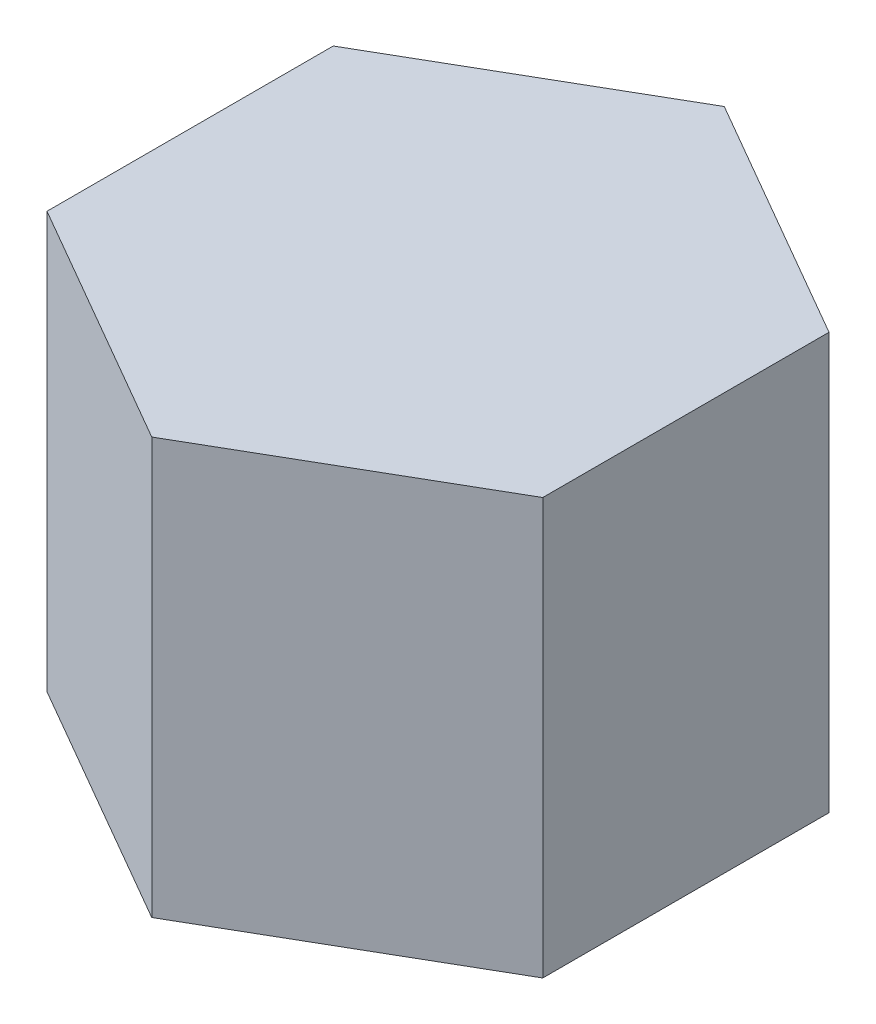
ISO-10303-21;
HEADER;
FILE_DESCRIPTION(('STEP AP214'),'2;1');
FILE_NAME('part.step','',(''),(''),'','','');
FILE_SCHEMA(('AUTOMOTIVE_DESIGN { 1 0 10303 214 1 1 1 1 }'));
ENDSEC;
DATA;
#1=APPLICATION_CONTEXT('core data for automotive mechanical design processes');
#2=APPLICATION_PROTOCOL_DEFINITION('international standard','automotive_design',2000,#1);
#3=PRODUCT_CONTEXT('',#1,'mechanical');
#4=PRODUCT('Part','Part','',(#3));
#5=PRODUCT_RELATED_PRODUCT_CATEGORY('part','',(#4));
#6=PRODUCT_DEFINITION_FORMATION('','',#4);
#7=PRODUCT_DEFINITION_CONTEXT('part definition',#1,'design');
#8=PRODUCT_DEFINITION('design','',#6,#7);
#9=PRODUCT_DEFINITION_SHAPE('','',#8);
#10=(LENGTH_UNIT() NAMED_UNIT(*) SI_UNIT(.MILLI.,.METRE.));
#11=(NAMED_UNIT(*) PLANE_ANGLE_UNIT() SI_UNIT($,.RADIAN.));
#12=(NAMED_UNIT(*) SI_UNIT($,.STERADIAN.) SOLID_ANGLE_UNIT());
#13=UNCERTAINTY_MEASURE_WITH_UNIT(LENGTH_MEASURE(1.E-05),#10,'distance_accuracy_value','');
#14=(GEOMETRIC_REPRESENTATION_CONTEXT(3) GLOBAL_UNCERTAINTY_ASSIGNED_CONTEXT((#13)) GLOBAL_UNIT_ASSIGNED_CONTEXT((#10,
#11,#12)) REPRESENTATION_CONTEXT('',''));
#15=CARTESIAN_POINT('',(0.,0.,0.));
#16=DIRECTION('',(0.,0.,1.));
#17=DIRECTION('',(1.,0.,0.));
#18=AXIS2_PLACEMENT_3D('',#15,#16,#17);
#19=CARTESIAN_POINT('',(201.839551417382,-147.556598747966,292.547996624279));
#20=DIRECTION('',(-0.500000000000096,0.,-0.866025403784383));
#21=DIRECTION('',(-0.866025403784383,0.,0.500000000000096));
#22=AXIS2_PLACEMENT_3D('',#19,#20,#21);
#23=PLANE('',#22);
#24=CARTESIAN_POINT('',(202.142660308706,-147.047793579175,292.372996624279));
#25=DIRECTION('',(-0.866025403784383,0.,0.500000000000096));
#26=VECTOR('',#25,1.);
#27=LINE('',#24,#26);
#28=CARTESIAN_POINT('',(202.142660308706,-147.047793579175,292.372996624279));
#29=VERTEX_POINT('',#28);
#30=CARTESIAN_POINT('',(201.839551417382,-147.047793579175,292.547996624279));
#31=VERTEX_POINT('',#30);
#32=EDGE_CURVE('E170',#29,#31,#27,.T.);
#33=ORIENTED_EDGE('',*,*,#32,.T.);
#34=CARTESIAN_POINT('',(201.839551417382,-147.556598747966,292.547996624279));
#35=DIRECTION('',(0.,1.,0.));
#36=VECTOR('',#35,1.);
#37=LINE('',#34,#36);
#38=CARTESIAN_POINT('',(201.839551417382,-147.556598747966,292.547996624279));
#39=VERTEX_POINT('',#38);
#40=EDGE_CURVE('E35',#39,#31,#37,.T.);
#41=ORIENTED_EDGE('',*,*,#40,.F.);
#42=CARTESIAN_POINT('',(202.142660308706,-147.556598747966,292.372996624279));
#43=DIRECTION('',(-0.866025403784383,0.,0.500000000000096));
#44=VECTOR('',#43,1.);
#45=LINE('',#42,#44);
#46=CARTESIAN_POINT('',(202.142660308706,-147.556598747966,292.372996624279));
#47=VERTEX_POINT('',#46);
#48=EDGE_CURVE('E159',#47,#39,#45,.T.);
#49=ORIENTED_EDGE('',*,*,#48,.F.);
#50=CARTESIAN_POINT('',(202.142660308706,-147.556598747966,292.372996624279));
#51=DIRECTION('',(0.,1.,0.));
#52=VECTOR('',#51,1.);
#53=LINE('',#50,#52);
#54=EDGE_CURVE('E10',#47,#29,#53,.T.);
#55=ORIENTED_EDGE('',*,*,#54,.T.);
#56=EDGE_LOOP('',(#33,#41,#49,#55));
#57=FACE_BOUND('',#56,.T.);
#58=ADVANCED_FACE('F16',(#57),#23,.F.);
#59=CARTESIAN_POINT('',(202.142660308706,-147.556598747966,291.594471220494));
#60=DIRECTION('',(-1.,0.,0.));
#61=DIRECTION('',(0.,-1.,0.));
#62=AXIS2_PLACEMENT_3D('',#59,#60,#61);
#63=PLANE('',#62);
#64=CARTESIAN_POINT('',(202.142660308706,-147.047793579175,292.022996624279));
#65=DIRECTION('',(0.,0.,1.));
#66=VECTOR('',#65,1.);
#67=LINE('',#64,#66);
#68=CARTESIAN_POINT('',(202.142660308706,-147.047793579175,292.022996624279));
#69=VERTEX_POINT('',#68);
#70=EDGE_CURVE('E167',#69,#29,#67,.T.);
#71=ORIENTED_EDGE('',*,*,#70,.T.);
#72=ORIENTED_EDGE('',*,*,#54,.F.);
#73=CARTESIAN_POINT('',(202.142660308706,-147.556598747966,292.022996624279));
#74=DIRECTION('',(0.,0.,1.));
#75=VECTOR('',#74,1.);
#76=LINE('',#73,#75);
#77=CARTESIAN_POINT('',(202.142660308706,-147.556598747966,292.022996624279));
#78=VERTEX_POINT('',#77);
#79=EDGE_CURVE('E156',#78,#47,#76,.T.);
#80=ORIENTED_EDGE('',*,*,#79,.F.);
#81=CARTESIAN_POINT('',(202.142660308706,-147.556598747966,292.022996624279));
#82=DIRECTION('',(0.,1.,0.));
#83=VECTOR('',#82,1.);
#84=LINE('',#81,#83);
#85=EDGE_CURVE('E27',#78,#69,#84,.T.);
#86=ORIENTED_EDGE('',*,*,#85,.T.);
#87=EDGE_LOOP('',(#71,#72,#80,#86));
#88=FACE_BOUND('',#87,.T.);
#89=ADVANCED_FACE('F189',(#88),#63,.F.);
#90=CARTESIAN_POINT('',(202.142660308706,-147.556598747966,292.022996624279));
#91=DIRECTION('',(-0.499999999999909,0.,0.866025403784491));
#92=DIRECTION('',(0.866025403784491,0.,0.499999999999909));
#93=AXIS2_PLACEMENT_3D('',#90,#91,#92);
#94=PLANE('',#93);
#95=CARTESIAN_POINT('',(201.839551417381,-147.047793579175,291.847996624279));
#96=DIRECTION('',(0.866025403784491,0.,0.499999999999909));
#97=VECTOR('',#96,1.);
#98=LINE('',#95,#97);
#99=CARTESIAN_POINT('',(201.839551417382,-147.047793579175,291.847996624279));
#100=VERTEX_POINT('',#99);
#101=EDGE_CURVE('E163',#100,#69,#98,.T.);
#102=ORIENTED_EDGE('',*,*,#101,.T.);
#103=ORIENTED_EDGE('',*,*,#85,.F.);
#104=CARTESIAN_POINT('',(201.839551417381,-147.556598747966,291.847996624279));
#105=DIRECTION('',(0.866025403784491,0.,0.499999999999909));
#106=VECTOR('',#105,1.);
#107=LINE('',#104,#106);
#108=CARTESIAN_POINT('',(201.839551417382,-147.556598747966,291.847996624279));
#109=VERTEX_POINT('',#108);
#110=EDGE_CURVE('E106',#109,#78,#107,.T.);
#111=ORIENTED_EDGE('',*,*,#110,.F.);
#112=CARTESIAN_POINT('',(201.839551417381,-147.556598747966,291.847996624279));
#113=DIRECTION('',(0.,1.,0.));
#114=VECTOR('',#113,1.);
#115=LINE('',#112,#114);
#116=EDGE_CURVE('E94',#109,#100,#115,.T.);
#117=ORIENTED_EDGE('',*,*,#116,.T.);
#118=EDGE_LOOP('',(#102,#103,#111,#117));
#119=FACE_BOUND('',#118,.T.);
#120=ADVANCED_FACE('F198',(#119),#94,.F.);
#121=CARTESIAN_POINT('',(201.839551417382,-147.556598747966,291.847996624279));
#122=DIRECTION('',(0.500000000000096,0.,0.866025403784383));
#123=DIRECTION('',(0.866025403784383,0.,-0.500000000000096));
#124=AXIS2_PLACEMENT_3D('',#121,#122,#123);
#125=PLANE('',#124);
#126=CARTESIAN_POINT('',(201.536442526057,-147.047793579175,292.022996624279));
#127=DIRECTION('',(0.866025403784383,0.,-0.500000000000096));
#128=VECTOR('',#127,1.);
#129=LINE('',#126,#128);
#130=CARTESIAN_POINT('',(201.536442526057,-147.047793579175,292.022996624279));
#131=VERTEX_POINT('',#130);
#132=EDGE_CURVE('E162',#131,#100,#129,.T.);
#133=ORIENTED_EDGE('',*,*,#132,.T.);
#134=ORIENTED_EDGE('',*,*,#116,.F.);
#135=CARTESIAN_POINT('',(201.536442526057,-147.556598747966,292.022996624279));
#136=DIRECTION('',(0.866025403784383,0.,-0.500000000000096));
#137=VECTOR('',#136,1.);
#138=LINE('',#135,#137);
#139=CARTESIAN_POINT('',(201.536442526057,-147.556598747966,292.022996624279));
#140=VERTEX_POINT('',#139);
#141=EDGE_CURVE('E98',#140,#109,#138,.T.);
#142=ORIENTED_EDGE('',*,*,#141,.F.);
#143=CARTESIAN_POINT('',(201.536442526057,-147.556598747966,292.022996624279));
#144=DIRECTION('',(0.,1.,0.));
#145=VECTOR('',#144,1.);
#146=LINE('',#143,#145);
#147=EDGE_CURVE('E79',#140,#131,#146,.T.);
#148=ORIENTED_EDGE('',*,*,#147,.T.);
#149=EDGE_LOOP('',(#133,#134,#142,#148));
#150=FACE_BOUND('',#149,.T.);
#151=ADVANCED_FACE('F100',(#150),#125,.F.);
#152=CARTESIAN_POINT('',(201.536442526057,-147.556598747966,291.594471220494));
#153=DIRECTION('',(1.,0.,0.));
#154=DIRECTION('',(0.,1.,0.));
#155=AXIS2_PLACEMENT_3D('',#152,#153,#154);
#156=PLANE('',#155);
#157=CARTESIAN_POINT('',(201.536442526057,-147.047793579175,292.372996624279));
#158=DIRECTION('',(0.,0.,-1.));
#159=VECTOR('',#158,1.);
#160=LINE('',#157,#159);
#161=CARTESIAN_POINT('',(201.536442526057,-147.047793579175,292.372996624279));
#162=VERTEX_POINT('',#161);
#163=EDGE_CURVE('E88',#162,#131,#160,.T.);
#164=ORIENTED_EDGE('',*,*,#163,.T.);
#165=ORIENTED_EDGE('',*,*,#147,.F.);
#166=CARTESIAN_POINT('',(201.536442526057,-147.556598747966,292.372996624279));
#167=DIRECTION('',(0.,0.,-1.));
#168=VECTOR('',#167,1.);
#169=LINE('',#166,#168);
#170=CARTESIAN_POINT('',(201.536442526057,-147.556598747966,292.372996624279));
#171=VERTEX_POINT('',#170);
#172=EDGE_CURVE('E84',#171,#140,#169,.T.);
#173=ORIENTED_EDGE('',*,*,#172,.F.);
#174=CARTESIAN_POINT('',(201.536442526057,-147.556598747966,292.372996624279));
#175=DIRECTION('',(0.,1.,0.));
#176=VECTOR('',#175,1.);
#177=LINE('',#174,#176);
#178=EDGE_CURVE('E58',#171,#162,#177,.T.);
#179=ORIENTED_EDGE('',*,*,#178,.T.);
#180=EDGE_LOOP('',(#164,#165,#173,#179));
#181=FACE_BOUND('',#180,.T.);
#182=ADVANCED_FACE('F82',(#181),#156,.F.);
#183=CARTESIAN_POINT('',(201.536442526057,-147.556598747966,292.372996624279));
#184=DIRECTION('',(0.499999999999978,0.,-0.866025403784452));
#185=DIRECTION('',(-0.866025403784452,0.,-0.499999999999978));
#186=AXIS2_PLACEMENT_3D('',#183,#184,#185);
#187=PLANE('',#186);
#188=CARTESIAN_POINT('',(201.839551417382,-147.047793579175,292.547996624279));
#189=DIRECTION('',(-0.866025403784452,0.,-0.499999999999978));
#190=VECTOR('',#189,1.);
#191=LINE('',#188,#190);
#192=EDGE_CURVE('E160',#31,#162,#191,.T.);
#193=ORIENTED_EDGE('',*,*,#192,.T.);
#194=ORIENTED_EDGE('',*,*,#178,.F.);
#195=CARTESIAN_POINT('',(201.839551417382,-147.556598747966,292.547996624279));
#196=DIRECTION('',(-0.866025403784452,0.,-0.499999999999978));
#197=VECTOR('',#196,1.);
#198=LINE('',#195,#197);
#199=EDGE_CURVE('E112',#39,#171,#198,.T.);
#200=ORIENTED_EDGE('',*,*,#199,.F.);
#201=ORIENTED_EDGE('',*,*,#40,.T.);
#202=EDGE_LOOP('',(#193,#194,#200,#201));
#203=FACE_BOUND('',#202,.T.);
#204=ADVANCED_FACE('F131',(#203),#187,.F.);
#205=CARTESIAN_POINT('',(206.491105863044,-147.556598747966,291.594471220494));
#206=DIRECTION('',(0.,1.,0.));
#207=DIRECTION('',(-1.,0.,0.));
#208=AXIS2_PLACEMENT_3D('',#205,#206,#207);
#209=PLANE('',#208);
#210=ORIENTED_EDGE('',*,*,#48,.T.);
#211=ORIENTED_EDGE('',*,*,#199,.T.);
#212=ORIENTED_EDGE('',*,*,#172,.T.);
#213=ORIENTED_EDGE('',*,*,#141,.T.);
#214=ORIENTED_EDGE('',*,*,#110,.T.);
#215=ORIENTED_EDGE('',*,*,#79,.T.);
#216=EDGE_LOOP('',(#210,#211,#212,#213,#214,#215));
#217=FACE_BOUND('',#216,.T.);
#218=ADVANCED_FACE('F111',(#217),#209,.F.);
#219=CARTESIAN_POINT('',(206.491105863044,-147.047793579175,291.594471220494));
#220=DIRECTION('',(0.,1.,0.));
#221=DIRECTION('',(-1.,0.,0.));
#222=AXIS2_PLACEMENT_3D('',#219,#220,#221);
#223=PLANE('',#222);
#224=ORIENTED_EDGE('',*,*,#32,.F.);
#225=ORIENTED_EDGE('',*,*,#70,.F.);
#226=ORIENTED_EDGE('',*,*,#101,.F.);
#227=ORIENTED_EDGE('',*,*,#132,.F.);
#228=ORIENTED_EDGE('',*,*,#163,.F.);
#229=ORIENTED_EDGE('',*,*,#192,.F.);
#230=EDGE_LOOP('',(#224,#225,#226,#227,#228,#229));
#231=FACE_BOUND('',#230,.T.);
#232=ADVANCED_FACE('F130',(#231),#223,.T.);
#233=CLOSED_SHELL('',(#58,#89,#120,#151,#182,#204,#218,#232));
#234=MANIFOLD_SOLID_BREP('B1',#233);
#235=ADVANCED_BREP_SHAPE_REPRESENTATION('',(#18,#234),#14);
#236=SHAPE_DEFINITION_REPRESENTATION(#9,#235);
ENDSEC;
END-ISO-10303-21;
